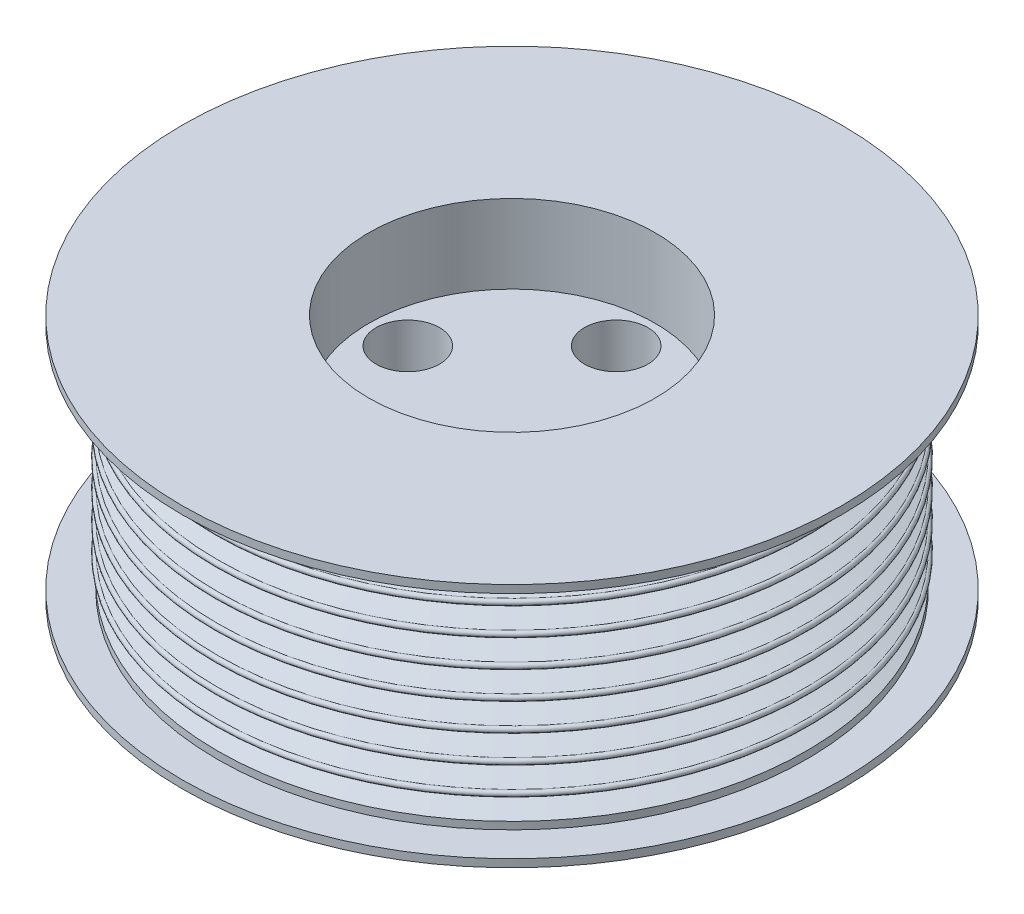
ISO-10303-21;
HEADER;
FILE_DESCRIPTION(('STEP AP214'),'2;1');
FILE_NAME('part.step','',(''),(''),'','','');
FILE_SCHEMA(('AUTOMOTIVE_DESIGN { 1 0 10303 214 1 1 1 1 }'));
ENDSEC;
DATA;
#1=APPLICATION_CONTEXT('core data for automotive mechanical design processes');
#2=APPLICATION_PROTOCOL_DEFINITION('international standard','automotive_design',2000,#1);
#3=PRODUCT_CONTEXT('',#1,'mechanical');
#4=PRODUCT('Part','Part','',(#3));
#5=PRODUCT_RELATED_PRODUCT_CATEGORY('part','',(#4));
#6=PRODUCT_DEFINITION_FORMATION('','',#4);
#7=PRODUCT_DEFINITION_CONTEXT('part definition',#1,'design');
#8=PRODUCT_DEFINITION('design','',#6,#7);
#9=PRODUCT_DEFINITION_SHAPE('','',#8);
#10=(LENGTH_UNIT() NAMED_UNIT(*) SI_UNIT(.MILLI.,.METRE.));
#11=(NAMED_UNIT(*) PLANE_ANGLE_UNIT() SI_UNIT($,.RADIAN.));
#12=(NAMED_UNIT(*) SI_UNIT($,.STERADIAN.) SOLID_ANGLE_UNIT());
#13=UNCERTAINTY_MEASURE_WITH_UNIT(LENGTH_MEASURE(1.E-05),#10,'distance_accuracy_value','');
#14=(GEOMETRIC_REPRESENTATION_CONTEXT(3) GLOBAL_UNCERTAINTY_ASSIGNED_CONTEXT((#13)) GLOBAL_UNIT_ASSIGNED_CONTEXT((#10,
#11,#12)) REPRESENTATION_CONTEXT('',''));
#15=CARTESIAN_POINT('',(0.,0.,0.));
#16=DIRECTION('',(0.,0.,1.));
#17=DIRECTION('',(1.,0.,0.));
#18=AXIS2_PLACEMENT_3D('',#15,#16,#17);
#19=CARTESIAN_POINT('',(42.672,-15.87246,0.));
#20=DIRECTION('',(0.,1.,0.));
#21=DIRECTION('',(0.,0.,1.));
#22=AXIS2_PLACEMENT_3D('',#19,#20,#21);
#23=PLANE('',#22);
#24=CARTESIAN_POINT('',(13.4874,-15.87246,-1.39621286104657E-13));
#25=DIRECTION('',(0.,-1.,0.));
#26=DIRECTION('',(0.,0.,-1.));
#27=AXIS2_PLACEMENT_3D('',#24,#25,#26);
#28=CIRCLE('',#27,4.10209999999999);
#29=CARTESIAN_POINT('',(13.4874,-15.87246,-4.10210000000013));
#30=VERTEX_POINT('',#29);
#31=EDGE_CURVE('E69',#30,#30,#28,.T.);
#32=ORIENTED_EDGE('',*,*,#31,.F.);
#33=EDGE_LOOP('',(#32));
#34=FACE_BOUND('',#33,.T.);
#35=CARTESIAN_POINT('',(0.,-15.87246,13.4874));
#36=DIRECTION('',(0.,-1.,0.));
#37=DIRECTION('',(0.,0.,-1.));
#38=AXIS2_PLACEMENT_3D('',#35,#36,#37);
#39=CIRCLE('',#38,4.10209999999999);
#40=CARTESIAN_POINT('',(0.,-15.87246,9.38530000000001));
#41=VERTEX_POINT('',#40);
#42=EDGE_CURVE('E59',#41,#41,#39,.T.);
#43=ORIENTED_EDGE('',*,*,#42,.F.);
#44=EDGE_LOOP('',(#43));
#45=FACE_BOUND('',#44,.T.);
#46=CARTESIAN_POINT('',(-13.4874,-15.87246,0.));
#47=DIRECTION('',(0.,-1.,0.));
#48=DIRECTION('',(0.,0.,-1.));
#49=AXIS2_PLACEMENT_3D('',#46,#47,#48);
#50=CIRCLE('',#49,4.10209999999999);
#51=CARTESIAN_POINT('',(-13.4874,-15.87246,-4.10209999999994));
#52=VERTEX_POINT('',#51);
#53=EDGE_CURVE('E56',#52,#52,#50,.T.);
#54=ORIENTED_EDGE('',*,*,#53,.F.);
#55=EDGE_LOOP('',(#54));
#56=FACE_BOUND('',#55,.T.);
#57=CARTESIAN_POINT('',(0.,-15.87246,-13.4874));
#58=DIRECTION('',(0.,-1.,0.));
#59=DIRECTION('',(0.,0.,-1.));
#60=AXIS2_PLACEMENT_3D('',#57,#58,#59);
#61=CIRCLE('',#60,4.10209999999999);
#62=CARTESIAN_POINT('',(0.,-15.87246,-17.5895));
#63=VERTEX_POINT('',#62);
#64=EDGE_CURVE('E53',#63,#63,#61,.T.);
#65=ORIENTED_EDGE('',*,*,#64,.F.);
#66=EDGE_LOOP('',(#65));
#67=FACE_BOUND('',#66,.T.);
#68=CARTESIAN_POINT('',(0.,-15.87246,0.));
#69=DIRECTION('',(0.,1.,0.));
#70=DIRECTION('',(0.,0.,1.));
#71=AXIS2_PLACEMENT_3D('',#68,#69,#70);
#72=CIRCLE('',#71,42.672);
#73=CARTESIAN_POINT('',(0.,-15.87246,42.672));
#74=VERTEX_POINT('',#73);
#75=EDGE_CURVE('E10',#74,#74,#72,.T.);
#76=ORIENTED_EDGE('',*,*,#75,.F.);
#77=EDGE_LOOP('',(#76));
#78=FACE_BOUND('',#77,.T.);
#79=ADVANCED_FACE('F33',(#34,#45,#56,#67,#78),#23,.F.);
#80=CARTESIAN_POINT('',(0.,15.87246,0.));
#81=DIRECTION('',(0.,1.,0.));
#82=DIRECTION('',(0.,0.,1.));
#83=AXIS2_PLACEMENT_3D('',#80,#81,#82);
#84=CYLINDRICAL_SURFACE('',#83,42.672);
#85=CARTESIAN_POINT('',(0.,-14.85646,0.));
#86=DIRECTION('',(0.,1.,0.));
#87=DIRECTION('',(0.,0.,1.));
#88=AXIS2_PLACEMENT_3D('',#85,#86,#87);
#89=CIRCLE('',#88,42.672);
#90=CARTESIAN_POINT('',(0.,-14.85646,42.672));
#91=VERTEX_POINT('',#90);
#92=EDGE_CURVE('E40',#91,#91,#89,.T.);
#93=ORIENTED_EDGE('',*,*,#92,.F.);
#94=EDGE_LOOP('',(#93));
#95=FACE_BOUND('',#94,.T.);
#96=ORIENTED_EDGE('',*,*,#75,.T.);
#97=EDGE_LOOP('',(#96));
#98=FACE_BOUND('',#97,.T.);
#99=ADVANCED_FACE('F191',(#95,#98),#84,.T.);
#100=CARTESIAN_POINT('',(42.672,-14.85646,0.));
#101=DIRECTION('',(0.,-1.,0.));
#102=DIRECTION('',(0.,0.,-1.));
#103=AXIS2_PLACEMENT_3D('',#100,#101,#102);
#104=PLANE('',#103);
#105=CARTESIAN_POINT('',(0.,-14.85646,0.));
#106=DIRECTION('',(0.,1.,0.));
#107=DIRECTION('',(0.,0.,1.));
#108=AXIS2_PLACEMENT_3D('',#105,#106,#107);
#109=CIRCLE('',#108,38.1);
#110=CARTESIAN_POINT('',(0.,-14.85646,38.1));
#111=VERTEX_POINT('',#110);
#112=EDGE_CURVE('E45',#111,#111,#109,.T.);
#113=ORIENTED_EDGE('',*,*,#112,.F.);
#114=EDGE_LOOP('',(#113));
#115=FACE_BOUND('',#114,.T.);
#116=ORIENTED_EDGE('',*,*,#92,.T.);
#117=EDGE_LOOP('',(#116));
#118=FACE_BOUND('',#117,.T.);
#119=ADVANCED_FACE('F188',(#115,#118),#104,.F.);
#120=CARTESIAN_POINT('',(0.,15.87246,0.));
#121=DIRECTION('',(0.,1.,0.));
#122=DIRECTION('',(0.,0.,1.));
#123=AXIS2_PLACEMENT_3D('',#120,#121,#122);
#124=CYLINDRICAL_SURFACE('',#123,38.1);
#125=CARTESIAN_POINT('',(0.,-13.90396,0.));
#126=DIRECTION('',(0.,1.,0.));
#127=DIRECTION('',(0.,0.,1.));
#128=AXIS2_PLACEMENT_3D('',#125,#126,#127);
#129=CIRCLE('',#128,38.1);
#130=CARTESIAN_POINT('',(0.,-13.90396,38.1));
#131=VERTEX_POINT('',#130);
#132=EDGE_CURVE('E181',#131,#131,#129,.T.);
#133=ORIENTED_EDGE('',*,*,#132,.F.);
#134=EDGE_LOOP('',(#133));
#135=FACE_BOUND('',#134,.T.);
#136=ORIENTED_EDGE('',*,*,#112,.T.);
#137=EDGE_LOOP('',(#136));
#138=FACE_BOUND('',#137,.T.);
#139=ADVANCED_FACE('F186',(#135,#138),#124,.T.);
#140=CARTESIAN_POINT('',(0.,-13.90396,0.));
#141=DIRECTION('',(0.,-1.,0.));
#142=DIRECTION('',(0.,0.,-1.));
#143=AXIS2_PLACEMENT_3D('',#140,#141,#142);
#144=CONICAL_SURFACE('',#143,38.1,1.22173047639603);
#145=CARTESIAN_POINT('',(0.,-12.88034,0.));
#146=DIRECTION('',(0.,1.,0.));
#147=DIRECTION('',(0.,0.,1.));
#148=AXIS2_PLACEMENT_3D('',#145,#146,#147);
#149=CIRCLE('',#148,35.2876271638978);
#150=CARTESIAN_POINT('',(0.,-12.88034,35.2876271638978));
#151=VERTEX_POINT('',#150);
#152=EDGE_CURVE('E178',#151,#151,#149,.T.);
#153=ORIENTED_EDGE('',*,*,#152,.F.);
#154=EDGE_LOOP('',(#153));
#155=FACE_BOUND('',#154,.T.);
#156=ORIENTED_EDGE('',*,*,#132,.T.);
#157=EDGE_LOOP('',(#156));
#158=FACE_BOUND('',#157,.T.);
#159=ADVANCED_FACE('F203',(#155,#158),#144,.T.);
#160=CARTESIAN_POINT('',(0.,-12.49934,0.));
#161=DIRECTION('',(0.,1.,0.));
#162=DIRECTION('',(0.,0.,1.));
#163=AXIS2_PLACEMENT_3D('',#160,#161,#162);
#164=TOROIDAL_SURFACE('',#163,35.2876271638978,0.380999999999997);
#165=CARTESIAN_POINT('',(0.,-12.11834,0.));
#166=DIRECTION('',(0.,1.,0.));
#167=DIRECTION('',(0.,0.,1.));
#168=AXIS2_PLACEMENT_3D('',#165,#166,#167);
#169=CIRCLE('',#168,35.2876271638978);
#170=CARTESIAN_POINT('',(0.,-12.11834,35.2876271638978));
#171=VERTEX_POINT('',#170);
#172=EDGE_CURVE('E175',#171,#171,#169,.T.);
#173=ORIENTED_EDGE('',*,*,#172,.F.);
#174=EDGE_LOOP('',(#173));
#175=FACE_BOUND('',#174,.T.);
#176=ORIENTED_EDGE('',*,*,#152,.T.);
#177=EDGE_LOOP('',(#176));
#178=FACE_BOUND('',#177,.T.);
#179=ADVANCED_FACE('F207',(#175,#178),#164,.F.);
#180=CARTESIAN_POINT('',(0.,-12.11834,0.));
#181=DIRECTION('',(0.,1.,0.));
#182=DIRECTION('',(0.,0.,1.));
#183=AXIS2_PLACEMENT_3D('',#180,#181,#182);
#184=CONICAL_SURFACE('',#183,35.2876271638978,1.22173047639604);
#185=CARTESIAN_POINT('',(0.,-11.09472,0.));
#186=DIRECTION('',(0.,1.,0.));
#187=DIRECTION('',(0.,0.,1.));
#188=AXIS2_PLACEMENT_3D('',#185,#186,#187);
#189=CIRCLE('',#188,38.1);
#190=CARTESIAN_POINT('',(0.,-11.09472,38.1));
#191=VERTEX_POINT('',#190);
#192=EDGE_CURVE('E172',#191,#191,#189,.T.);
#193=ORIENTED_EDGE('',*,*,#192,.F.);
#194=EDGE_LOOP('',(#193));
#195=FACE_BOUND('',#194,.T.);
#196=ORIENTED_EDGE('',*,*,#172,.T.);
#197=EDGE_LOOP('',(#196));
#198=FACE_BOUND('',#197,.T.);
#199=ADVANCED_FACE('F211',(#195,#198),#184,.T.);
#200=CARTESIAN_POINT('',(0.,-10.71372,0.));
#201=DIRECTION('',(0.,1.,0.));
#202=DIRECTION('',(0.,0.,1.));
#203=AXIS2_PLACEMENT_3D('',#200,#201,#202);
#204=TOROIDAL_SURFACE('',#203,38.1,0.380999999999999);
#205=CARTESIAN_POINT('',(0.,-10.33272,0.));
#206=DIRECTION('',(0.,1.,0.));
#207=DIRECTION('',(0.,0.,1.));
#208=AXIS2_PLACEMENT_3D('',#205,#206,#207);
#209=CIRCLE('',#208,38.1);
#210=CARTESIAN_POINT('',(0.,-10.33272,38.1));
#211=VERTEX_POINT('',#210);
#212=EDGE_CURVE('E169',#211,#211,#209,.T.);
#213=ORIENTED_EDGE('',*,*,#212,.F.);
#214=EDGE_LOOP('',(#213));
#215=FACE_BOUND('',#214,.T.);
#216=ORIENTED_EDGE('',*,*,#192,.T.);
#217=EDGE_LOOP('',(#216));
#218=FACE_BOUND('',#217,.T.);
#219=ADVANCED_FACE('F215',(#215,#218),#204,.T.);
#220=CARTESIAN_POINT('',(0.,-10.33272,0.));
#221=DIRECTION('',(0.,-1.,0.));
#222=DIRECTION('',(0.,0.,-1.));
#223=AXIS2_PLACEMENT_3D('',#220,#221,#222);
#224=CONICAL_SURFACE('',#223,38.1,1.22173047639603);
#225=CARTESIAN_POINT('',(0.,-9.30909999999999,0.));
#226=DIRECTION('',(0.,1.,0.));
#227=DIRECTION('',(0.,0.,1.));
#228=AXIS2_PLACEMENT_3D('',#225,#226,#227);
#229=CIRCLE('',#228,35.2876271638978);
#230=CARTESIAN_POINT('',(0.,-9.30909999999999,35.2876271638978));
#231=VERTEX_POINT('',#230);
#232=EDGE_CURVE('E166',#231,#231,#229,.T.);
#233=ORIENTED_EDGE('',*,*,#232,.F.);
#234=EDGE_LOOP('',(#233));
#235=FACE_BOUND('',#234,.T.);
#236=ORIENTED_EDGE('',*,*,#212,.T.);
#237=EDGE_LOOP('',(#236));
#238=FACE_BOUND('',#237,.T.);
#239=ADVANCED_FACE('F219',(#235,#238),#224,.T.);
#240=CARTESIAN_POINT('',(0.,-8.92809999999999,0.));
#241=DIRECTION('',(0.,1.,0.));
#242=DIRECTION('',(0.,0.,1.));
#243=AXIS2_PLACEMENT_3D('',#240,#241,#242);
#244=TOROIDAL_SURFACE('',#243,35.2876271638978,0.381);
#245=CARTESIAN_POINT('',(0.,-8.54709999999999,0.));
#246=DIRECTION('',(0.,1.,0.));
#247=DIRECTION('',(0.,0.,1.));
#248=AXIS2_PLACEMENT_3D('',#245,#246,#247);
#249=CIRCLE('',#248,35.2876271638978);
#250=CARTESIAN_POINT('',(0.,-8.54709999999999,35.2876271638978));
#251=VERTEX_POINT('',#250);
#252=EDGE_CURVE('E163',#251,#251,#249,.T.);
#253=ORIENTED_EDGE('',*,*,#252,.F.);
#254=EDGE_LOOP('',(#253));
#255=FACE_BOUND('',#254,.T.);
#256=ORIENTED_EDGE('',*,*,#232,.T.);
#257=EDGE_LOOP('',(#256));
#258=FACE_BOUND('',#257,.T.);
#259=ADVANCED_FACE('F223',(#255,#258),#244,.F.);
#260=CARTESIAN_POINT('',(0.,-8.54709999999999,0.));
#261=DIRECTION('',(0.,1.,0.));
#262=DIRECTION('',(0.,0.,1.));
#263=AXIS2_PLACEMENT_3D('',#260,#261,#262);
#264=CONICAL_SURFACE('',#263,35.2876271638978,1.22173047639604);
#265=CARTESIAN_POINT('',(0.,-7.52348,0.));
#266=DIRECTION('',(0.,1.,0.));
#267=DIRECTION('',(0.,0.,1.));
#268=AXIS2_PLACEMENT_3D('',#265,#266,#267);
#269=CIRCLE('',#268,38.1);
#270=CARTESIAN_POINT('',(0.,-7.52348,38.1));
#271=VERTEX_POINT('',#270);
#272=EDGE_CURVE('E160',#271,#271,#269,.T.);
#273=ORIENTED_EDGE('',*,*,#272,.F.);
#274=EDGE_LOOP('',(#273));
#275=FACE_BOUND('',#274,.T.);
#276=ORIENTED_EDGE('',*,*,#252,.T.);
#277=EDGE_LOOP('',(#276));
#278=FACE_BOUND('',#277,.T.);
#279=ADVANCED_FACE('F227',(#275,#278),#264,.T.);
#280=CARTESIAN_POINT('',(0.,-7.14248,0.));
#281=DIRECTION('',(0.,1.,0.));
#282=DIRECTION('',(0.,0.,1.));
#283=AXIS2_PLACEMENT_3D('',#280,#281,#282);
#284=TOROIDAL_SURFACE('',#283,38.1,0.381000000000001);
#285=CARTESIAN_POINT('',(0.,-6.76148,0.));
#286=DIRECTION('',(0.,1.,0.));
#287=DIRECTION('',(0.,0.,1.));
#288=AXIS2_PLACEMENT_3D('',#285,#286,#287);
#289=CIRCLE('',#288,38.1);
#290=CARTESIAN_POINT('',(0.,-6.76148,38.1));
#291=VERTEX_POINT('',#290);
#292=EDGE_CURVE('E157',#291,#291,#289,.T.);
#293=ORIENTED_EDGE('',*,*,#292,.F.);
#294=EDGE_LOOP('',(#293));
#295=FACE_BOUND('',#294,.T.);
#296=ORIENTED_EDGE('',*,*,#272,.T.);
#297=EDGE_LOOP('',(#296));
#298=FACE_BOUND('',#297,.T.);
#299=ADVANCED_FACE('F231',(#295,#298),#284,.T.);
#300=CARTESIAN_POINT('',(0.,-6.76148,0.));
#301=DIRECTION('',(0.,-1.,0.));
#302=DIRECTION('',(0.,0.,-1.));
#303=AXIS2_PLACEMENT_3D('',#300,#301,#302);
#304=CONICAL_SURFACE('',#303,38.1,1.22173047639603);
#305=CARTESIAN_POINT('',(0.,-5.73785999999998,0.));
#306=DIRECTION('',(0.,1.,0.));
#307=DIRECTION('',(0.,0.,1.));
#308=AXIS2_PLACEMENT_3D('',#305,#306,#307);
#309=CIRCLE('',#308,35.2876271638978);
#310=CARTESIAN_POINT('',(0.,-5.73785999999998,35.2876271638978));
#311=VERTEX_POINT('',#310);
#312=EDGE_CURVE('E154',#311,#311,#309,.T.);
#313=ORIENTED_EDGE('',*,*,#312,.F.);
#314=EDGE_LOOP('',(#313));
#315=FACE_BOUND('',#314,.T.);
#316=ORIENTED_EDGE('',*,*,#292,.T.);
#317=EDGE_LOOP('',(#316));
#318=FACE_BOUND('',#317,.T.);
#319=ADVANCED_FACE('F235',(#315,#318),#304,.T.);
#320=CARTESIAN_POINT('',(0.,-5.35685999999998,0.));
#321=DIRECTION('',(0.,1.,0.));
#322=DIRECTION('',(0.,0.,1.));
#323=AXIS2_PLACEMENT_3D('',#320,#321,#322);
#324=TOROIDAL_SURFACE('',#323,35.2876271638978,0.381);
#325=CARTESIAN_POINT('',(0.,-4.97585999999998,0.));
#326=DIRECTION('',(0.,1.,0.));
#327=DIRECTION('',(0.,0.,1.));
#328=AXIS2_PLACEMENT_3D('',#325,#326,#327);
#329=CIRCLE('',#328,35.2876271638978);
#330=CARTESIAN_POINT('',(0.,-4.97585999999998,35.2876271638978));
#331=VERTEX_POINT('',#330);
#332=EDGE_CURVE('E151',#331,#331,#329,.T.);
#333=ORIENTED_EDGE('',*,*,#332,.F.);
#334=EDGE_LOOP('',(#333));
#335=FACE_BOUND('',#334,.T.);
#336=ORIENTED_EDGE('',*,*,#312,.T.);
#337=EDGE_LOOP('',(#336));
#338=FACE_BOUND('',#337,.T.);
#339=ADVANCED_FACE('F239',(#335,#338),#324,.F.);
#340=CARTESIAN_POINT('',(0.,-4.97585999999998,0.));
#341=DIRECTION('',(0.,1.,0.));
#342=DIRECTION('',(0.,0.,1.));
#343=AXIS2_PLACEMENT_3D('',#340,#341,#342);
#344=CONICAL_SURFACE('',#343,35.2876271638978,1.22173047639604);
#345=CARTESIAN_POINT('',(0.,-3.95224,0.));
#346=DIRECTION('',(0.,1.,0.));
#347=DIRECTION('',(0.,0.,1.));
#348=AXIS2_PLACEMENT_3D('',#345,#346,#347);
#349=CIRCLE('',#348,38.1);
#350=CARTESIAN_POINT('',(0.,-3.95224,38.1));
#351=VERTEX_POINT('',#350);
#352=EDGE_CURVE('E148',#351,#351,#349,.T.);
#353=ORIENTED_EDGE('',*,*,#352,.F.);
#354=EDGE_LOOP('',(#353));
#355=FACE_BOUND('',#354,.T.);
#356=ORIENTED_EDGE('',*,*,#332,.T.);
#357=EDGE_LOOP('',(#356));
#358=FACE_BOUND('',#357,.T.);
#359=ADVANCED_FACE('F243',(#355,#358),#344,.T.);
#360=CARTESIAN_POINT('',(0.,-3.57124,0.));
#361=DIRECTION('',(0.,1.,0.));
#362=DIRECTION('',(0.,0.,1.));
#363=AXIS2_PLACEMENT_3D('',#360,#361,#362);
#364=TOROIDAL_SURFACE('',#363,38.1,0.380999999999999);
#365=CARTESIAN_POINT('',(0.,-3.19024,0.));
#366=DIRECTION('',(0.,1.,0.));
#367=DIRECTION('',(0.,0.,1.));
#368=AXIS2_PLACEMENT_3D('',#365,#366,#367);
#369=CIRCLE('',#368,38.1);
#370=CARTESIAN_POINT('',(0.,-3.19024,38.1));
#371=VERTEX_POINT('',#370);
#372=EDGE_CURVE('E145',#371,#371,#369,.T.);
#373=ORIENTED_EDGE('',*,*,#372,.F.);
#374=EDGE_LOOP('',(#373));
#375=FACE_BOUND('',#374,.T.);
#376=ORIENTED_EDGE('',*,*,#352,.T.);
#377=EDGE_LOOP('',(#376));
#378=FACE_BOUND('',#377,.T.);
#379=ADVANCED_FACE('F247',(#375,#378),#364,.T.);
#380=CARTESIAN_POINT('',(0.,-3.19024,0.));
#381=DIRECTION('',(0.,-1.,0.));
#382=DIRECTION('',(0.,0.,-1.));
#383=AXIS2_PLACEMENT_3D('',#380,#381,#382);
#384=CONICAL_SURFACE('',#383,38.1,1.22173047639603);
#385=CARTESIAN_POINT('',(0.,-2.16661999999999,0.));
#386=DIRECTION('',(0.,1.,0.));
#387=DIRECTION('',(0.,0.,1.));
#388=AXIS2_PLACEMENT_3D('',#385,#386,#387);
#389=CIRCLE('',#388,35.2876271638978);
#390=CARTESIAN_POINT('',(0.,-2.16661999999999,35.2876271638978));
#391=VERTEX_POINT('',#390);
#392=EDGE_CURVE('E142',#391,#391,#389,.T.);
#393=ORIENTED_EDGE('',*,*,#392,.F.);
#394=EDGE_LOOP('',(#393));
#395=FACE_BOUND('',#394,.T.);
#396=ORIENTED_EDGE('',*,*,#372,.T.);
#397=EDGE_LOOP('',(#396));
#398=FACE_BOUND('',#397,.T.);
#399=ADVANCED_FACE('F251',(#395,#398),#384,.T.);
#400=CARTESIAN_POINT('',(0.,-1.78561999999999,0.));
#401=DIRECTION('',(0.,1.,0.));
#402=DIRECTION('',(0.,0.,1.));
#403=AXIS2_PLACEMENT_3D('',#400,#401,#402);
#404=TOROIDAL_SURFACE('',#403,35.2876271638978,0.381);
#405=CARTESIAN_POINT('',(0.,-1.40461999999999,0.));
#406=DIRECTION('',(0.,1.,0.));
#407=DIRECTION('',(0.,0.,1.));
#408=AXIS2_PLACEMENT_3D('',#405,#406,#407);
#409=CIRCLE('',#408,35.2876271638978);
#410=CARTESIAN_POINT('',(0.,-1.40461999999999,35.2876271638978));
#411=VERTEX_POINT('',#410);
#412=EDGE_CURVE('E139',#411,#411,#409,.T.);
#413=ORIENTED_EDGE('',*,*,#412,.F.);
#414=EDGE_LOOP('',(#413));
#415=FACE_BOUND('',#414,.T.);
#416=ORIENTED_EDGE('',*,*,#392,.T.);
#417=EDGE_LOOP('',(#416));
#418=FACE_BOUND('',#417,.T.);
#419=ADVANCED_FACE('F255',(#415,#418),#404,.F.);
#420=CARTESIAN_POINT('',(0.,-1.40461999999999,0.));
#421=DIRECTION('',(0.,1.,0.));
#422=DIRECTION('',(0.,0.,1.));
#423=AXIS2_PLACEMENT_3D('',#420,#421,#422);
#424=CONICAL_SURFACE('',#423,35.2876271638978,1.22173047639604);
#425=CARTESIAN_POINT('',(0.,-0.381000000000003,0.));
#426=DIRECTION('',(0.,1.,0.));
#427=DIRECTION('',(0.,0.,1.));
#428=AXIS2_PLACEMENT_3D('',#425,#426,#427);
#429=CIRCLE('',#428,38.1);
#430=CARTESIAN_POINT('',(0.,-0.381000000000003,38.1));
#431=VERTEX_POINT('',#430);
#432=EDGE_CURVE('E136',#431,#431,#429,.T.);
#433=ORIENTED_EDGE('',*,*,#432,.F.);
#434=EDGE_LOOP('',(#433));
#435=FACE_BOUND('',#434,.T.);
#436=ORIENTED_EDGE('',*,*,#412,.T.);
#437=EDGE_LOOP('',(#436));
#438=FACE_BOUND('',#437,.T.);
#439=ADVANCED_FACE('F259',(#435,#438),#424,.T.);
#440=CARTESIAN_POINT('',(0.,0.,0.));
#441=DIRECTION('',(0.,1.,0.));
#442=DIRECTION('',(0.,0.,1.));
#443=AXIS2_PLACEMENT_3D('',#440,#441,#442);
#444=TOROIDAL_SURFACE('',#443,38.1,0.380999999999999);
#445=CARTESIAN_POINT('',(0.,0.380999999999996,0.));
#446=DIRECTION('',(0.,1.,0.));
#447=DIRECTION('',(0.,0.,1.));
#448=AXIS2_PLACEMENT_3D('',#445,#446,#447);
#449=CIRCLE('',#448,38.1);
#450=CARTESIAN_POINT('',(0.,0.380999999999996,38.1));
#451=VERTEX_POINT('',#450);
#452=EDGE_CURVE('E133',#451,#451,#449,.T.);
#453=ORIENTED_EDGE('',*,*,#452,.F.);
#454=EDGE_LOOP('',(#453));
#455=FACE_BOUND('',#454,.T.);
#456=ORIENTED_EDGE('',*,*,#432,.T.);
#457=EDGE_LOOP('',(#456));
#458=FACE_BOUND('',#457,.T.);
#459=ADVANCED_FACE('F263',(#455,#458),#444,.T.);
#460=CARTESIAN_POINT('',(0.,0.380999999999996,0.));
#461=DIRECTION('',(0.,-1.,0.));
#462=DIRECTION('',(0.,0.,-1.));
#463=AXIS2_PLACEMENT_3D('',#460,#461,#462);
#464=CONICAL_SURFACE('',#463,38.1,1.22173047639603);
#465=CARTESIAN_POINT('',(0.,1.40462000000001,0.));
#466=DIRECTION('',(0.,1.,0.));
#467=DIRECTION('',(0.,0.,1.));
#468=AXIS2_PLACEMENT_3D('',#465,#466,#467);
#469=CIRCLE('',#468,35.2876271638978);
#470=CARTESIAN_POINT('',(0.,1.40462000000001,35.2876271638978));
#471=VERTEX_POINT('',#470);
#472=EDGE_CURVE('E130',#471,#471,#469,.T.);
#473=ORIENTED_EDGE('',*,*,#472,.F.);
#474=EDGE_LOOP('',(#473));
#475=FACE_BOUND('',#474,.T.);
#476=ORIENTED_EDGE('',*,*,#452,.T.);
#477=EDGE_LOOP('',(#476));
#478=FACE_BOUND('',#477,.T.);
#479=ADVANCED_FACE('F267',(#475,#478),#464,.T.);
#480=CARTESIAN_POINT('',(0.,1.78562000000001,0.));
#481=DIRECTION('',(0.,1.,0.));
#482=DIRECTION('',(0.,0.,1.));
#483=AXIS2_PLACEMENT_3D('',#480,#481,#482);
#484=TOROIDAL_SURFACE('',#483,35.2876271638978,0.381);
#485=CARTESIAN_POINT('',(0.,2.16662000000001,0.));
#486=DIRECTION('',(0.,1.,0.));
#487=DIRECTION('',(0.,0.,1.));
#488=AXIS2_PLACEMENT_3D('',#485,#486,#487);
#489=CIRCLE('',#488,35.2876271638978);
#490=CARTESIAN_POINT('',(0.,2.16662000000001,35.2876271638978));
#491=VERTEX_POINT('',#490);
#492=EDGE_CURVE('E127',#491,#491,#489,.T.);
#493=ORIENTED_EDGE('',*,*,#492,.F.);
#494=EDGE_LOOP('',(#493));
#495=FACE_BOUND('',#494,.T.);
#496=ORIENTED_EDGE('',*,*,#472,.T.);
#497=EDGE_LOOP('',(#496));
#498=FACE_BOUND('',#497,.T.);
#499=ADVANCED_FACE('F271',(#495,#498),#484,.F.);
#500=CARTESIAN_POINT('',(0.,2.16662000000001,0.));
#501=DIRECTION('',(0.,1.,0.));
#502=DIRECTION('',(0.,0.,1.));
#503=AXIS2_PLACEMENT_3D('',#500,#501,#502);
#504=CONICAL_SURFACE('',#503,35.2876271638978,1.22173047639604);
#505=CARTESIAN_POINT('',(0.,3.19024,0.));
#506=DIRECTION('',(0.,1.,0.));
#507=DIRECTION('',(0.,0.,1.));
#508=AXIS2_PLACEMENT_3D('',#505,#506,#507);
#509=CIRCLE('',#508,38.1);
#510=CARTESIAN_POINT('',(0.,3.19024,38.1));
#511=VERTEX_POINT('',#510);
#512=EDGE_CURVE('E124',#511,#511,#509,.T.);
#513=ORIENTED_EDGE('',*,*,#512,.F.);
#514=EDGE_LOOP('',(#513));
#515=FACE_BOUND('',#514,.T.);
#516=ORIENTED_EDGE('',*,*,#492,.T.);
#517=EDGE_LOOP('',(#516));
#518=FACE_BOUND('',#517,.T.);
#519=ADVANCED_FACE('F275',(#515,#518),#504,.T.);
#520=CARTESIAN_POINT('',(0.,3.57124,0.));
#521=DIRECTION('',(0.,1.,0.));
#522=DIRECTION('',(0.,0.,1.));
#523=AXIS2_PLACEMENT_3D('',#520,#521,#522);
#524=TOROIDAL_SURFACE('',#523,38.1,0.381);
#525=CARTESIAN_POINT('',(0.,3.95224,0.));
#526=DIRECTION('',(0.,1.,0.));
#527=DIRECTION('',(0.,0.,1.));
#528=AXIS2_PLACEMENT_3D('',#525,#526,#527);
#529=CIRCLE('',#528,38.1);
#530=CARTESIAN_POINT('',(0.,3.95224,38.1));
#531=VERTEX_POINT('',#530);
#532=EDGE_CURVE('E121',#531,#531,#529,.T.);
#533=ORIENTED_EDGE('',*,*,#532,.F.);
#534=EDGE_LOOP('',(#533));
#535=FACE_BOUND('',#534,.T.);
#536=ORIENTED_EDGE('',*,*,#512,.T.);
#537=EDGE_LOOP('',(#536));
#538=FACE_BOUND('',#537,.T.);
#539=ADVANCED_FACE('F279',(#535,#538),#524,.T.);
#540=CARTESIAN_POINT('',(0.,3.95224,0.));
#541=DIRECTION('',(0.,-1.,0.));
#542=DIRECTION('',(0.,0.,-1.));
#543=AXIS2_PLACEMENT_3D('',#540,#541,#542);
#544=CONICAL_SURFACE('',#543,38.1,1.22173047639603);
#545=CARTESIAN_POINT('',(0.,4.97586000000001,0.));
#546=DIRECTION('',(0.,1.,0.));
#547=DIRECTION('',(0.,0.,1.));
#548=AXIS2_PLACEMENT_3D('',#545,#546,#547);
#549=CIRCLE('',#548,35.2876271638978);
#550=CARTESIAN_POINT('',(0.,4.97586000000001,35.2876271638978));
#551=VERTEX_POINT('',#550);
#552=EDGE_CURVE('E118',#551,#551,#549,.T.);
#553=ORIENTED_EDGE('',*,*,#552,.F.);
#554=EDGE_LOOP('',(#553));
#555=FACE_BOUND('',#554,.T.);
#556=ORIENTED_EDGE('',*,*,#532,.T.);
#557=EDGE_LOOP('',(#556));
#558=FACE_BOUND('',#557,.T.);
#559=ADVANCED_FACE('F283',(#555,#558),#544,.T.);
#560=CARTESIAN_POINT('',(0.,5.35686000000001,0.));
#561=DIRECTION('',(0.,1.,0.));
#562=DIRECTION('',(0.,0.,1.));
#563=AXIS2_PLACEMENT_3D('',#560,#561,#562);
#564=TOROIDAL_SURFACE('',#563,35.2876271638978,0.381);
#565=CARTESIAN_POINT('',(0.,5.73786000000001,0.));
#566=DIRECTION('',(0.,1.,0.));
#567=DIRECTION('',(0.,0.,1.));
#568=AXIS2_PLACEMENT_3D('',#565,#566,#567);
#569=CIRCLE('',#568,35.2876271638978);
#570=CARTESIAN_POINT('',(0.,5.73786000000001,35.2876271638978));
#571=VERTEX_POINT('',#570);
#572=EDGE_CURVE('E115',#571,#571,#569,.T.);
#573=ORIENTED_EDGE('',*,*,#572,.F.);
#574=EDGE_LOOP('',(#573));
#575=FACE_BOUND('',#574,.T.);
#576=ORIENTED_EDGE('',*,*,#552,.T.);
#577=EDGE_LOOP('',(#576));
#578=FACE_BOUND('',#577,.T.);
#579=ADVANCED_FACE('F287',(#575,#578),#564,.F.);
#580=CARTESIAN_POINT('',(0.,5.73786000000001,0.));
#581=DIRECTION('',(0.,1.,0.));
#582=DIRECTION('',(0.,0.,1.));
#583=AXIS2_PLACEMENT_3D('',#580,#581,#582);
#584=CONICAL_SURFACE('',#583,35.2876271638978,1.22173047639604);
#585=CARTESIAN_POINT('',(0.,6.76148,0.));
#586=DIRECTION('',(0.,1.,0.));
#587=DIRECTION('',(0.,0.,1.));
#588=AXIS2_PLACEMENT_3D('',#585,#586,#587);
#589=CIRCLE('',#588,38.1);
#590=CARTESIAN_POINT('',(0.,6.76148,38.1));
#591=VERTEX_POINT('',#590);
#592=EDGE_CURVE('E112',#591,#591,#589,.T.);
#593=ORIENTED_EDGE('',*,*,#592,.F.);
#594=EDGE_LOOP('',(#593));
#595=FACE_BOUND('',#594,.T.);
#596=ORIENTED_EDGE('',*,*,#572,.T.);
#597=EDGE_LOOP('',(#596));
#598=FACE_BOUND('',#597,.T.);
#599=ADVANCED_FACE('F291',(#595,#598),#584,.T.);
#600=CARTESIAN_POINT('',(0.,7.14247999999999,0.));
#601=DIRECTION('',(0.,1.,0.));
#602=DIRECTION('',(0.,0.,1.));
#603=AXIS2_PLACEMENT_3D('',#600,#601,#602);
#604=TOROIDAL_SURFACE('',#603,38.1,0.380999999999999);
#605=CARTESIAN_POINT('',(0.,7.52347999999999,0.));
#606=DIRECTION('',(0.,1.,0.));
#607=DIRECTION('',(0.,0.,1.));
#608=AXIS2_PLACEMENT_3D('',#605,#606,#607);
#609=CIRCLE('',#608,38.1);
#610=CARTESIAN_POINT('',(0.,7.52347999999999,38.1));
#611=VERTEX_POINT('',#610);
#612=EDGE_CURVE('E109',#611,#611,#609,.T.);
#613=ORIENTED_EDGE('',*,*,#612,.F.);
#614=EDGE_LOOP('',(#613));
#615=FACE_BOUND('',#614,.T.);
#616=ORIENTED_EDGE('',*,*,#592,.T.);
#617=EDGE_LOOP('',(#616));
#618=FACE_BOUND('',#617,.T.);
#619=ADVANCED_FACE('F295',(#615,#618),#604,.T.);
#620=CARTESIAN_POINT('',(0.,7.52347999999999,0.));
#621=DIRECTION('',(0.,-1.,0.));
#622=DIRECTION('',(0.,0.,-1.));
#623=AXIS2_PLACEMENT_3D('',#620,#621,#622);
#624=CONICAL_SURFACE('',#623,38.1,1.22173047639603);
#625=CARTESIAN_POINT('',(0.,8.5471,0.));
#626=DIRECTION('',(0.,1.,0.));
#627=DIRECTION('',(0.,0.,1.));
#628=AXIS2_PLACEMENT_3D('',#625,#626,#627);
#629=CIRCLE('',#628,35.2876271638978);
#630=CARTESIAN_POINT('',(0.,8.5471,35.2876271638978));
#631=VERTEX_POINT('',#630);
#632=EDGE_CURVE('E106',#631,#631,#629,.T.);
#633=ORIENTED_EDGE('',*,*,#632,.F.);
#634=EDGE_LOOP('',(#633));
#635=FACE_BOUND('',#634,.T.);
#636=ORIENTED_EDGE('',*,*,#612,.T.);
#637=EDGE_LOOP('',(#636));
#638=FACE_BOUND('',#637,.T.);
#639=ADVANCED_FACE('F299',(#635,#638),#624,.T.);
#640=CARTESIAN_POINT('',(0.,8.9281,0.));
#641=DIRECTION('',(0.,1.,0.));
#642=DIRECTION('',(0.,0.,1.));
#643=AXIS2_PLACEMENT_3D('',#640,#641,#642);
#644=TOROIDAL_SURFACE('',#643,35.2876271638978,0.381);
#645=CARTESIAN_POINT('',(0.,9.3091,0.));
#646=DIRECTION('',(0.,1.,0.));
#647=DIRECTION('',(0.,0.,1.));
#648=AXIS2_PLACEMENT_3D('',#645,#646,#647);
#649=CIRCLE('',#648,35.2876271638978);
#650=CARTESIAN_POINT('',(0.,9.3091,35.2876271638978));
#651=VERTEX_POINT('',#650);
#652=EDGE_CURVE('E103',#651,#651,#649,.T.);
#653=ORIENTED_EDGE('',*,*,#652,.F.);
#654=EDGE_LOOP('',(#653));
#655=FACE_BOUND('',#654,.T.);
#656=ORIENTED_EDGE('',*,*,#632,.T.);
#657=EDGE_LOOP('',(#656));
#658=FACE_BOUND('',#657,.T.);
#659=ADVANCED_FACE('F303',(#655,#658),#644,.F.);
#660=CARTESIAN_POINT('',(0.,9.3091,0.));
#661=DIRECTION('',(0.,1.,0.));
#662=DIRECTION('',(0.,0.,1.));
#663=AXIS2_PLACEMENT_3D('',#660,#661,#662);
#664=CONICAL_SURFACE('',#663,35.2876271638978,1.22173047639604);
#665=CARTESIAN_POINT('',(0.,10.33272,0.));
#666=DIRECTION('',(0.,1.,0.));
#667=DIRECTION('',(0.,0.,1.));
#668=AXIS2_PLACEMENT_3D('',#665,#666,#667);
#669=CIRCLE('',#668,38.1);
#670=CARTESIAN_POINT('',(0.,10.33272,38.1));
#671=VERTEX_POINT('',#670);
#672=EDGE_CURVE('E100',#671,#671,#669,.T.);
#673=ORIENTED_EDGE('',*,*,#672,.F.);
#674=EDGE_LOOP('',(#673));
#675=FACE_BOUND('',#674,.T.);
#676=ORIENTED_EDGE('',*,*,#652,.T.);
#677=EDGE_LOOP('',(#676));
#678=FACE_BOUND('',#677,.T.);
#679=ADVANCED_FACE('F307',(#675,#678),#664,.T.);
#680=CARTESIAN_POINT('',(0.,10.71372,0.));
#681=DIRECTION('',(0.,1.,0.));
#682=DIRECTION('',(0.,0.,1.));
#683=AXIS2_PLACEMENT_3D('',#680,#681,#682);
#684=TOROIDAL_SURFACE('',#683,38.1,0.381);
#685=CARTESIAN_POINT('',(0.,11.09472,0.));
#686=DIRECTION('',(0.,1.,0.));
#687=DIRECTION('',(0.,0.,1.));
#688=AXIS2_PLACEMENT_3D('',#685,#686,#687);
#689=CIRCLE('',#688,38.1);
#690=CARTESIAN_POINT('',(0.,11.09472,38.1));
#691=VERTEX_POINT('',#690);
#692=EDGE_CURVE('E97',#691,#691,#689,.T.);
#693=ORIENTED_EDGE('',*,*,#692,.F.);
#694=EDGE_LOOP('',(#693));
#695=FACE_BOUND('',#694,.T.);
#696=ORIENTED_EDGE('',*,*,#672,.T.);
#697=EDGE_LOOP('',(#696));
#698=FACE_BOUND('',#697,.T.);
#699=ADVANCED_FACE('F311',(#695,#698),#684,.T.);
#700=CARTESIAN_POINT('',(0.,11.09472,0.));
#701=DIRECTION('',(0.,-1.,0.));
#702=DIRECTION('',(0.,0.,-1.));
#703=AXIS2_PLACEMENT_3D('',#700,#701,#702);
#704=CONICAL_SURFACE('',#703,38.1,1.22173047639603);
#705=CARTESIAN_POINT('',(0.,12.11834,0.));
#706=DIRECTION('',(0.,1.,0.));
#707=DIRECTION('',(0.,0.,1.));
#708=AXIS2_PLACEMENT_3D('',#705,#706,#707);
#709=CIRCLE('',#708,35.2876271638978);
#710=CARTESIAN_POINT('',(0.,12.11834,35.2876271638978));
#711=VERTEX_POINT('',#710);
#712=EDGE_CURVE('E94',#711,#711,#709,.T.);
#713=ORIENTED_EDGE('',*,*,#712,.F.);
#714=EDGE_LOOP('',(#713));
#715=FACE_BOUND('',#714,.T.);
#716=ORIENTED_EDGE('',*,*,#692,.T.);
#717=EDGE_LOOP('',(#716));
#718=FACE_BOUND('',#717,.T.);
#719=ADVANCED_FACE('F315',(#715,#718),#704,.T.);
#720=CARTESIAN_POINT('',(0.,12.49934,0.));
#721=DIRECTION('',(0.,1.,0.));
#722=DIRECTION('',(0.,0.,1.));
#723=AXIS2_PLACEMENT_3D('',#720,#721,#722);
#724=TOROIDAL_SURFACE('',#723,35.2876271638978,0.380999999999999);
#725=CARTESIAN_POINT('',(0.,12.88034,0.));
#726=DIRECTION('',(0.,1.,0.));
#727=DIRECTION('',(0.,0.,1.));
#728=AXIS2_PLACEMENT_3D('',#725,#726,#727);
#729=CIRCLE('',#728,35.2876271638978);
#730=CARTESIAN_POINT('',(0.,12.88034,35.2876271638978));
#731=VERTEX_POINT('',#730);
#732=EDGE_CURVE('E91',#731,#731,#729,.T.);
#733=ORIENTED_EDGE('',*,*,#732,.F.);
#734=EDGE_LOOP('',(#733));
#735=FACE_BOUND('',#734,.T.);
#736=ORIENTED_EDGE('',*,*,#712,.T.);
#737=EDGE_LOOP('',(#736));
#738=FACE_BOUND('',#737,.T.);
#739=ADVANCED_FACE('F319',(#735,#738),#724,.F.);
#740=CARTESIAN_POINT('',(0.,12.88034,0.));
#741=DIRECTION('',(0.,1.,0.));
#742=DIRECTION('',(0.,0.,1.));
#743=AXIS2_PLACEMENT_3D('',#740,#741,#742);
#744=CONICAL_SURFACE('',#743,35.2876271638978,1.22173047639604);
#745=CARTESIAN_POINT('',(0.,13.90396,0.));
#746=DIRECTION('',(0.,1.,0.));
#747=DIRECTION('',(0.,0.,1.));
#748=AXIS2_PLACEMENT_3D('',#745,#746,#747);
#749=CIRCLE('',#748,38.1);
#750=CARTESIAN_POINT('',(0.,13.90396,38.1));
#751=VERTEX_POINT('',#750);
#752=EDGE_CURVE('E88',#751,#751,#749,.T.);
#753=ORIENTED_EDGE('',*,*,#752,.F.);
#754=EDGE_LOOP('',(#753));
#755=FACE_BOUND('',#754,.T.);
#756=ORIENTED_EDGE('',*,*,#732,.T.);
#757=EDGE_LOOP('',(#756));
#758=FACE_BOUND('',#757,.T.);
#759=ADVANCED_FACE('F323',(#755,#758),#744,.T.);
#760=CARTESIAN_POINT('',(0.,15.87246,0.));
#761=DIRECTION('',(0.,1.,0.));
#762=DIRECTION('',(0.,0.,1.));
#763=AXIS2_PLACEMENT_3D('',#760,#761,#762);
#764=CYLINDRICAL_SURFACE('',#763,38.1);
#765=CARTESIAN_POINT('',(0.,14.85646,0.));
#766=DIRECTION('',(0.,1.,0.));
#767=DIRECTION('',(0.,0.,1.));
#768=AXIS2_PLACEMENT_3D('',#765,#766,#767);
#769=CIRCLE('',#768,38.1);
#770=CARTESIAN_POINT('',(0.,14.85646,38.1));
#771=VERTEX_POINT('',#770);
#772=EDGE_CURVE('E85',#771,#771,#769,.T.);
#773=ORIENTED_EDGE('',*,*,#772,.F.);
#774=EDGE_LOOP('',(#773));
#775=FACE_BOUND('',#774,.T.);
#776=ORIENTED_EDGE('',*,*,#752,.T.);
#777=EDGE_LOOP('',(#776));
#778=FACE_BOUND('',#777,.T.);
#779=ADVANCED_FACE('F327',(#775,#778),#764,.T.);
#780=CARTESIAN_POINT('',(42.672,14.85646,0.));
#781=DIRECTION('',(0.,1.,0.));
#782=DIRECTION('',(0.,0.,1.));
#783=AXIS2_PLACEMENT_3D('',#780,#781,#782);
#784=PLANE('',#783);
#785=CARTESIAN_POINT('',(0.,14.85646,0.));
#786=DIRECTION('',(0.,1.,0.));
#787=DIRECTION('',(0.,0.,1.));
#788=AXIS2_PLACEMENT_3D('',#785,#786,#787);
#789=CIRCLE('',#788,42.672);
#790=CARTESIAN_POINT('',(0.,14.85646,42.672));
#791=VERTEX_POINT('',#790);
#792=EDGE_CURVE('E82',#791,#791,#789,.T.);
#793=ORIENTED_EDGE('',*,*,#792,.F.);
#794=EDGE_LOOP('',(#793));
#795=FACE_BOUND('',#794,.T.);
#796=ORIENTED_EDGE('',*,*,#772,.T.);
#797=EDGE_LOOP('',(#796));
#798=FACE_BOUND('',#797,.T.);
#799=ADVANCED_FACE('F331',(#795,#798),#784,.F.);
#800=CARTESIAN_POINT('',(0.,15.87246,0.));
#801=DIRECTION('',(0.,1.,0.));
#802=DIRECTION('',(0.,0.,1.));
#803=AXIS2_PLACEMENT_3D('',#800,#801,#802);
#804=CYLINDRICAL_SURFACE('',#803,42.672);
#805=CARTESIAN_POINT('',(0.,15.87246,0.));
#806=DIRECTION('',(0.,1.,0.));
#807=DIRECTION('',(0.,0.,1.));
#808=AXIS2_PLACEMENT_3D('',#805,#806,#807);
#809=CIRCLE('',#808,42.672);
#810=CARTESIAN_POINT('',(0.,15.87246,42.672));
#811=VERTEX_POINT('',#810);
#812=EDGE_CURVE('E77',#811,#811,#809,.T.);
#813=ORIENTED_EDGE('',*,*,#812,.F.);
#814=EDGE_LOOP('',(#813));
#815=FACE_BOUND('',#814,.T.);
#816=ORIENTED_EDGE('',*,*,#792,.T.);
#817=EDGE_LOOP('',(#816));
#818=FACE_BOUND('',#817,.T.);
#819=ADVANCED_FACE('F335',(#815,#818),#804,.T.);
#820=CARTESIAN_POINT('',(38.1,15.87246,0.));
#821=DIRECTION('',(0.,-1.,0.));
#822=DIRECTION('',(0.,0.,-1.));
#823=AXIS2_PLACEMENT_3D('',#820,#821,#822);
#824=PLANE('',#823);
#825=CARTESIAN_POINT('',(0.,15.87246,0.));
#826=DIRECTION('',(0.,1.,0.));
#827=DIRECTION('',(0.,0.,1.));
#828=AXIS2_PLACEMENT_3D('',#825,#826,#827);
#829=CIRCLE('',#828,18.542);
#830=CARTESIAN_POINT('',(0.,15.87246,18.542));
#831=VERTEX_POINT('',#830);
#832=EDGE_CURVE('E52',#831,#831,#829,.T.);
#833=ORIENTED_EDGE('',*,*,#832,.F.);
#834=EDGE_LOOP('',(#833));
#835=FACE_BOUND('',#834,.T.);
#836=ORIENTED_EDGE('',*,*,#812,.T.);
#837=EDGE_LOOP('',(#836));
#838=FACE_BOUND('',#837,.T.);
#839=ADVANCED_FACE('F339',(#835,#838),#824,.F.);
#840=CARTESIAN_POINT('',(0.,5.71245999999998,0.));
#841=DIRECTION('',(0.,1.,0.));
#842=DIRECTION('',(0.,0.,1.));
#843=AXIS2_PLACEMENT_3D('',#840,#841,#842);
#844=CYLINDRICAL_SURFACE('',#843,18.542);
#845=CARTESIAN_POINT('',(0.,5.71245999999998,0.));
#846=DIRECTION('',(0.,1.,0.));
#847=DIRECTION('',(0.,0.,1.));
#848=AXIS2_PLACEMENT_3D('',#845,#846,#847);
#849=CIRCLE('',#848,18.542);
#850=CARTESIAN_POINT('',(0.,5.71245999999998,18.542));
#851=VERTEX_POINT('',#850);
#852=EDGE_CURVE('E74',#851,#851,#849,.T.);
#853=ORIENTED_EDGE('',*,*,#852,.F.);
#854=EDGE_LOOP('',(#853));
#855=FACE_BOUND('',#854,.T.);
#856=ORIENTED_EDGE('',*,*,#832,.T.);
#857=EDGE_LOOP('',(#856));
#858=FACE_BOUND('',#857,.T.);
#859=ADVANCED_FACE('F343',(#855,#858),#844,.F.);
#860=CARTESIAN_POINT('',(0.,5.71245999999998,0.));
#861=DIRECTION('',(0.,1.,0.));
#862=DIRECTION('',(0.,0.,1.));
#863=AXIS2_PLACEMENT_3D('',#860,#861,#862);
#864=PLANE('',#863);
#865=CARTESIAN_POINT('',(13.4874,5.71245999999998,-1.39621286104657E-13));
#866=DIRECTION('',(0.,1.,0.));
#867=DIRECTION('',(0.,0.,1.));
#868=AXIS2_PLACEMENT_3D('',#865,#866,#867);
#869=CIRCLE('',#868,4.10209999999999);
#870=CARTESIAN_POINT('',(13.4874,5.71245999999998,4.10209999999985));
#871=VERTEX_POINT('',#870);
#872=EDGE_CURVE('E36',#871,#871,#869,.T.);
#873=ORIENTED_EDGE('',*,*,#872,.F.);
#874=EDGE_LOOP('',(#873));
#875=FACE_BOUND('',#874,.T.);
#876=CARTESIAN_POINT('',(0.,5.71245999999998,13.4874));
#877=DIRECTION('',(0.,1.,0.));
#878=DIRECTION('',(0.,0.,1.));
#879=AXIS2_PLACEMENT_3D('',#876,#877,#878);
#880=CIRCLE('',#879,4.10209999999999);
#881=CARTESIAN_POINT('',(0.,5.71245999999998,17.5895));
#882=VERTEX_POINT('',#881);
#883=EDGE_CURVE('E57',#882,#882,#880,.T.);
#884=ORIENTED_EDGE('',*,*,#883,.F.);
#885=EDGE_LOOP('',(#884));
#886=FACE_BOUND('',#885,.T.);
#887=CARTESIAN_POINT('',(-13.4874,5.71245999999998,0.));
#888=DIRECTION('',(0.,1.,0.));
#889=DIRECTION('',(0.,0.,1.));
#890=AXIS2_PLACEMENT_3D('',#887,#888,#889);
#891=CIRCLE('',#890,4.10209999999999);
#892=CARTESIAN_POINT('',(-13.4874,5.71245999999998,4.10210000000004));
#893=VERTEX_POINT('',#892);
#894=EDGE_CURVE('E54',#893,#893,#891,.T.);
#895=ORIENTED_EDGE('',*,*,#894,.F.);
#896=EDGE_LOOP('',(#895));
#897=FACE_BOUND('',#896,.T.);
#898=CARTESIAN_POINT('',(0.,5.71245999999998,-13.4874));
#899=DIRECTION('',(0.,1.,0.));
#900=DIRECTION('',(0.,0.,1.));
#901=AXIS2_PLACEMENT_3D('',#898,#899,#900);
#902=CIRCLE('',#901,4.10209999999999);
#903=CARTESIAN_POINT('',(0.,5.71245999999998,-9.38530000000001));
#904=VERTEX_POINT('',#903);
#905=EDGE_CURVE('E49',#904,#904,#902,.T.);
#906=ORIENTED_EDGE('',*,*,#905,.F.);
#907=EDGE_LOOP('',(#906));
#908=FACE_BOUND('',#907,.T.);
#909=ORIENTED_EDGE('',*,*,#852,.T.);
#910=EDGE_LOOP('',(#909));
#911=FACE_BOUND('',#910,.T.);
#912=ADVANCED_FACE('F347',(#875,#886,#897,#908,#911),#864,.T.);
#913=CARTESIAN_POINT('',(0.,-15.87246,-13.4874));
#914=DIRECTION('',(0.,-1.,0.));
#915=DIRECTION('',(0.,0.,-1.));
#916=AXIS2_PLACEMENT_3D('',#913,#914,#915);
#917=CYLINDRICAL_SURFACE('',#916,4.10209999999999);
#918=ORIENTED_EDGE('',*,*,#905,.T.);
#919=EDGE_LOOP('',(#918));
#920=FACE_BOUND('',#919,.T.);
#921=ORIENTED_EDGE('',*,*,#64,.T.);
#922=EDGE_LOOP('',(#921));
#923=FACE_BOUND('',#922,.T.);
#924=ADVANCED_FACE('F351',(#920,#923),#917,.F.);
#925=CARTESIAN_POINT('',(-13.4874,-15.87246,0.));
#926=DIRECTION('',(0.,-1.,0.));
#927=DIRECTION('',(0.,0.,-1.));
#928=AXIS2_PLACEMENT_3D('',#925,#926,#927);
#929=CYLINDRICAL_SURFACE('',#928,4.10209999999999);
#930=ORIENTED_EDGE('',*,*,#894,.T.);
#931=EDGE_LOOP('',(#930));
#932=FACE_BOUND('',#931,.T.);
#933=ORIENTED_EDGE('',*,*,#53,.T.);
#934=EDGE_LOOP('',(#933));
#935=FACE_BOUND('',#934,.T.);
#936=ADVANCED_FACE('F355',(#932,#935),#929,.F.);
#937=CARTESIAN_POINT('',(0.,-15.87246,13.4874));
#938=DIRECTION('',(0.,-1.,0.));
#939=DIRECTION('',(0.,0.,-1.));
#940=AXIS2_PLACEMENT_3D('',#937,#938,#939);
#941=CYLINDRICAL_SURFACE('',#940,4.10209999999999);
#942=ORIENTED_EDGE('',*,*,#883,.T.);
#943=EDGE_LOOP('',(#942));
#944=FACE_BOUND('',#943,.T.);
#945=ORIENTED_EDGE('',*,*,#42,.T.);
#946=EDGE_LOOP('',(#945));
#947=FACE_BOUND('',#946,.T.);
#948=ADVANCED_FACE('F359',(#944,#947),#941,.F.);
#949=CARTESIAN_POINT('',(13.4874,-15.87246,-1.39621286104657E-13));
#950=DIRECTION('',(0.,-1.,0.));
#951=DIRECTION('',(0.,0.,-1.));
#952=AXIS2_PLACEMENT_3D('',#949,#950,#951);
#953=CYLINDRICAL_SURFACE('',#952,4.10209999999999);
#954=ORIENTED_EDGE('',*,*,#872,.T.);
#955=EDGE_LOOP('',(#954));
#956=FACE_BOUND('',#955,.T.);
#957=ORIENTED_EDGE('',*,*,#31,.T.);
#958=EDGE_LOOP('',(#957));
#959=FACE_BOUND('',#958,.T.);
#960=ADVANCED_FACE('F363',(#956,#959),#953,.F.);
#961=CLOSED_SHELL('',(#79,#99,#119,#139,#159,#179,#199,#219,#239,#259,#279,#299,#319,#339,#359,
#379,#399,#419,#439,#459,#479,#499,#519,#539,#559,#579,#599,#619,#639,#659,#679,#699,#719,#739,
#759,#779,#799,#819,#839,#859,#912,#924,#936,#948,#960));
#962=MANIFOLD_SOLID_BREP('B2',#961);
#963=ADVANCED_BREP_SHAPE_REPRESENTATION('',(#18,#962),#14);
#964=SHAPE_DEFINITION_REPRESENTATION(#9,#963);
ENDSEC;
END-ISO-10303-21;
